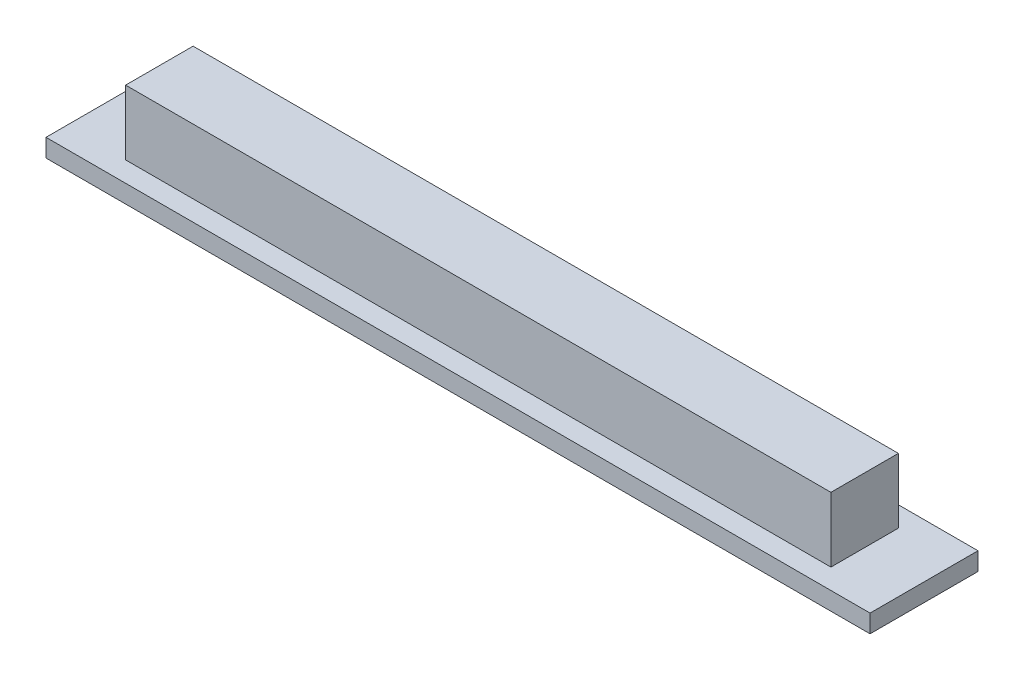
ISO-10303-21;
HEADER;
FILE_DESCRIPTION(('STEP AP214'),'2;1');
FILE_NAME('part.step','',(''),(''),'','','');
FILE_SCHEMA(('AUTOMOTIVE_DESIGN { 1 0 10303 214 1 1 1 1 }'));
ENDSEC;
DATA;
#1=APPLICATION_CONTEXT('core data for automotive mechanical design processes');
#2=APPLICATION_PROTOCOL_DEFINITION('international standard','automotive_design',2000,#1);
#3=PRODUCT_CONTEXT('',#1,'mechanical');
#4=PRODUCT('Part','Part','',(#3));
#5=PRODUCT_RELATED_PRODUCT_CATEGORY('part','',(#4));
#6=PRODUCT_DEFINITION_FORMATION('','',#4);
#7=PRODUCT_DEFINITION_CONTEXT('part definition',#1,'design');
#8=PRODUCT_DEFINITION('design','',#6,#7);
#9=PRODUCT_DEFINITION_SHAPE('','',#8);
#10=(LENGTH_UNIT() NAMED_UNIT(*) SI_UNIT(.MILLI.,.METRE.));
#11=(NAMED_UNIT(*) PLANE_ANGLE_UNIT() SI_UNIT($,.RADIAN.));
#12=(NAMED_UNIT(*) SI_UNIT($,.STERADIAN.) SOLID_ANGLE_UNIT());
#13=UNCERTAINTY_MEASURE_WITH_UNIT(LENGTH_MEASURE(1.E-05),#10,'distance_accuracy_value','');
#14=(GEOMETRIC_REPRESENTATION_CONTEXT(3) GLOBAL_UNCERTAINTY_ASSIGNED_CONTEXT((#13)) GLOBAL_UNIT_ASSIGNED_CONTEXT((#10,
#11,#12)) REPRESENTATION_CONTEXT('',''));
#15=CARTESIAN_POINT('',(0.,0.,0.));
#16=DIRECTION('',(0.,0.,1.));
#17=DIRECTION('',(1.,0.,0.));
#18=AXIS2_PLACEMENT_3D('',#15,#16,#17);
#19=CARTESIAN_POINT('',(0.,1.,0.));
#20=DIRECTION('',(0.,1.,0.));
#21=DIRECTION('',(0.,0.,1.));
#22=AXIS2_PLACEMENT_3D('',#19,#20,#21);
#23=PLANE('',#22);
#24=DIRECTION('',(0.,0.,-1.));
#25=VECTOR('',#24,1.);
#26=CARTESIAN_POINT('',(22.9,1.,-3.));
#27=LINE('',#26,#25);
#28=CARTESIAN_POINT('',(22.9,1.,3.));
#29=VERTEX_POINT('',#28);
#30=CARTESIAN_POINT('',(22.9,1.,-3.));
#31=VERTEX_POINT('',#30);
#32=EDGE_CURVE('E131',#29,#31,#27,.T.);
#33=ORIENTED_EDGE('',*,*,#32,.T.);
#34=DIRECTION('',(-1.,0.,0.));
#35=VECTOR('',#34,1.);
#36=CARTESIAN_POINT('',(-22.9,1.,-3.));
#37=LINE('',#36,#35);
#38=CARTESIAN_POINT('',(-22.9,1.,-3.));
#39=VERTEX_POINT('',#38);
#40=EDGE_CURVE('E134',#31,#39,#37,.T.);
#41=ORIENTED_EDGE('',*,*,#40,.T.);
#42=DIRECTION('',(0.,0.,1.));
#43=VECTOR('',#42,1.);
#44=CARTESIAN_POINT('',(-22.9,1.,-3.));
#45=LINE('',#44,#43);
#46=CARTESIAN_POINT('',(-22.9,1.,3.));
#47=VERTEX_POINT('',#46);
#48=EDGE_CURVE('E137',#39,#47,#45,.T.);
#49=ORIENTED_EDGE('',*,*,#48,.T.);
#50=DIRECTION('',(1.,0.,0.));
#51=VECTOR('',#50,1.);
#52=CARTESIAN_POINT('',(-22.9,1.,3.));
#53=LINE('',#52,#51);
#54=EDGE_CURVE('E139',#47,#29,#53,.T.);
#55=ORIENTED_EDGE('',*,*,#54,.T.);
#56=EDGE_LOOP('',(#33,#41,#49,#55));
#57=FACE_BOUND('',#56,.T.);
#58=DIRECTION('',(1.,0.,0.));
#59=VECTOR('',#58,1.);
#60=CARTESIAN_POINT('',(-19.6,1.,1.875));
#61=LINE('',#60,#59);
#62=CARTESIAN_POINT('',(-19.6,1.,1.875));
#63=VERTEX_POINT('',#62);
#64=CARTESIAN_POINT('',(19.6,1.,1.875));
#65=VERTEX_POINT('',#64);
#66=EDGE_CURVE('E50',#63,#65,#61,.T.);
#67=ORIENTED_EDGE('',*,*,#66,.F.);
#68=DIRECTION('',(0.,0.,1.));
#69=VECTOR('',#68,1.);
#70=CARTESIAN_POINT('',(-19.6,1.,-1.875));
#71=LINE('',#70,#69);
#72=CARTESIAN_POINT('',(-19.6,1.,-1.875));
#73=VERTEX_POINT('',#72);
#74=EDGE_CURVE('E121',#73,#63,#71,.T.);
#75=ORIENTED_EDGE('',*,*,#74,.F.);
#76=DIRECTION('',(1.,0.,0.));
#77=VECTOR('',#76,1.);
#78=CARTESIAN_POINT('',(-19.6,1.,-1.875));
#79=LINE('',#78,#77);
#80=CARTESIAN_POINT('',(19.6,1.,-1.875));
#81=VERTEX_POINT('',#80);
#82=EDGE_CURVE('E118',#73,#81,#79,.T.);
#83=ORIENTED_EDGE('',*,*,#82,.T.);
#84=DIRECTION('',(0.,0.,1.));
#85=VECTOR('',#84,1.);
#86=CARTESIAN_POINT('',(19.6,1.,-1.875));
#87=LINE('',#86,#85);
#88=EDGE_CURVE('E55',#81,#65,#87,.T.);
#89=ORIENTED_EDGE('',*,*,#88,.T.);
#90=EDGE_LOOP('',(#67,#75,#83,#89));
#91=FACE_BOUND('',#90,.T.);
#92=ADVANCED_FACE('F35',(#57,#91),#23,.T.);
#93=CARTESIAN_POINT('',(22.9,1.,-3.));
#94=DIRECTION('',(-1.,0.,0.));
#95=DIRECTION('',(0.,0.,1.));
#96=AXIS2_PLACEMENT_3D('',#93,#94,#95);
#97=PLANE('',#96);
#98=DIRECTION('',(0.,0.,-1.));
#99=VECTOR('',#98,1.);
#100=CARTESIAN_POINT('',(22.9,0.,-3.));
#101=LINE('',#100,#99);
#102=CARTESIAN_POINT('',(22.9,0.,3.));
#103=VERTEX_POINT('',#102);
#104=CARTESIAN_POINT('',(22.9,0.,-3.));
#105=VERTEX_POINT('',#104);
#106=EDGE_CURVE('E122',#103,#105,#101,.T.);
#107=ORIENTED_EDGE('',*,*,#106,.T.);
#108=DIRECTION('',(0.,-1.,0.));
#109=VECTOR('',#108,1.);
#110=CARTESIAN_POINT('',(22.9,1.,-3.));
#111=LINE('',#110,#109);
#112=EDGE_CURVE('E11',#31,#105,#111,.T.);
#113=ORIENTED_EDGE('',*,*,#112,.F.);
#114=ORIENTED_EDGE('',*,*,#32,.F.);
#115=DIRECTION('',(0.,-1.,0.));
#116=VECTOR('',#115,1.);
#117=CARTESIAN_POINT('',(22.9,1.,3.));
#118=LINE('',#117,#116);
#119=EDGE_CURVE('E140',#29,#103,#118,.T.);
#120=ORIENTED_EDGE('',*,*,#119,.T.);
#121=EDGE_LOOP('',(#107,#113,#114,#120));
#122=FACE_BOUND('',#121,.T.);
#123=ADVANCED_FACE('F37',(#122),#97,.F.);
#124=CARTESIAN_POINT('',(-22.9,1.,-3.));
#125=DIRECTION('',(0.,0.,1.));
#126=DIRECTION('',(1.,0.,0.));
#127=AXIS2_PLACEMENT_3D('',#124,#125,#126);
#128=PLANE('',#127);
#129=DIRECTION('',(-1.,0.,0.));
#130=VECTOR('',#129,1.);
#131=CARTESIAN_POINT('',(-22.9,0.,-3.));
#132=LINE('',#131,#130);
#133=CARTESIAN_POINT('',(-22.9,0.,-3.));
#134=VERTEX_POINT('',#133);
#135=EDGE_CURVE('E125',#105,#134,#132,.T.);
#136=ORIENTED_EDGE('',*,*,#135,.T.);
#137=DIRECTION('',(0.,-1.,0.));
#138=VECTOR('',#137,1.);
#139=CARTESIAN_POINT('',(-22.9,1.,-3.));
#140=LINE('',#139,#138);
#141=EDGE_CURVE('E43',#39,#134,#140,.T.);
#142=ORIENTED_EDGE('',*,*,#141,.F.);
#143=ORIENTED_EDGE('',*,*,#40,.F.);
#144=ORIENTED_EDGE('',*,*,#112,.T.);
#145=EDGE_LOOP('',(#136,#142,#143,#144));
#146=FACE_BOUND('',#145,.T.);
#147=ADVANCED_FACE('F170',(#146),#128,.F.);
#148=CARTESIAN_POINT('',(-22.9,1.,-3.));
#149=DIRECTION('',(1.,0.,0.));
#150=DIRECTION('',(0.,0.,-1.));
#151=AXIS2_PLACEMENT_3D('',#148,#149,#150);
#152=PLANE('',#151);
#153=DIRECTION('',(0.,0.,1.));
#154=VECTOR('',#153,1.);
#155=CARTESIAN_POINT('',(-22.9,0.,-3.));
#156=LINE('',#155,#154);
#157=CARTESIAN_POINT('',(-22.9,0.,3.));
#158=VERTEX_POINT('',#157);
#159=EDGE_CURVE('E143',#134,#158,#156,.T.);
#160=ORIENTED_EDGE('',*,*,#159,.T.);
#161=DIRECTION('',(0.,-1.,0.));
#162=VECTOR('',#161,1.);
#163=CARTESIAN_POINT('',(-22.9,1.,3.));
#164=LINE('',#163,#162);
#165=EDGE_CURVE('E148',#47,#158,#164,.T.);
#166=ORIENTED_EDGE('',*,*,#165,.F.);
#167=ORIENTED_EDGE('',*,*,#48,.F.);
#168=ORIENTED_EDGE('',*,*,#141,.T.);
#169=EDGE_LOOP('',(#160,#166,#167,#168));
#170=FACE_BOUND('',#169,.T.);
#171=ADVANCED_FACE('F155',(#170),#152,.F.);
#172=CARTESIAN_POINT('',(-22.9,1.,3.));
#173=DIRECTION('',(0.,0.,-1.));
#174=DIRECTION('',(-1.,0.,0.));
#175=AXIS2_PLACEMENT_3D('',#172,#173,#174);
#176=PLANE('',#175);
#177=DIRECTION('',(1.,0.,0.));
#178=VECTOR('',#177,1.);
#179=CARTESIAN_POINT('',(-22.9,0.,3.));
#180=LINE('',#179,#178);
#181=EDGE_CURVE('E135',#158,#103,#180,.T.);
#182=ORIENTED_EDGE('',*,*,#181,.T.);
#183=ORIENTED_EDGE('',*,*,#119,.F.);
#184=ORIENTED_EDGE('',*,*,#54,.F.);
#185=ORIENTED_EDGE('',*,*,#165,.T.);
#186=EDGE_LOOP('',(#182,#183,#184,#185));
#187=FACE_BOUND('',#186,.T.);
#188=ADVANCED_FACE('F164',(#187),#176,.F.);
#189=CARTESIAN_POINT('',(0.,0.,0.));
#190=DIRECTION('',(0.,1.,0.));
#191=DIRECTION('',(0.,0.,1.));
#192=AXIS2_PLACEMENT_3D('',#189,#190,#191);
#193=PLANE('',#192);
#194=ORIENTED_EDGE('',*,*,#106,.F.);
#195=ORIENTED_EDGE('',*,*,#181,.F.);
#196=ORIENTED_EDGE('',*,*,#159,.F.);
#197=ORIENTED_EDGE('',*,*,#135,.F.);
#198=EDGE_LOOP('',(#194,#195,#196,#197));
#199=FACE_BOUND('',#198,.T.);
#200=ADVANCED_FACE('F161',(#199),#193,.F.);
#201=CARTESIAN_POINT('',(-19.6,4.6,-1.875));
#202=DIRECTION('',(1.,0.,0.));
#203=DIRECTION('',(0.,0.,-1.));
#204=AXIS2_PLACEMENT_3D('',#201,#202,#203);
#205=PLANE('',#204);
#206=ORIENTED_EDGE('',*,*,#74,.T.);
#207=DIRECTION('',(0.,-1.,0.));
#208=VECTOR('',#207,1.);
#209=CARTESIAN_POINT('',(-19.6,4.6,1.875));
#210=LINE('',#209,#208);
#211=CARTESIAN_POINT('',(-19.6,4.6,1.875));
#212=VERTEX_POINT('',#211);
#213=EDGE_CURVE('E102',#212,#63,#210,.T.);
#214=ORIENTED_EDGE('',*,*,#213,.F.);
#215=DIRECTION('',(0.,0.,1.));
#216=VECTOR('',#215,1.);
#217=CARTESIAN_POINT('',(-19.6,4.6,-1.875));
#218=LINE('',#217,#216);
#219=CARTESIAN_POINT('',(-19.6,4.6,-1.875));
#220=VERTEX_POINT('',#219);
#221=EDGE_CURVE('E109',#220,#212,#218,.T.);
#222=ORIENTED_EDGE('',*,*,#221,.F.);
#223=DIRECTION('',(0.,-1.,0.));
#224=VECTOR('',#223,1.);
#225=CARTESIAN_POINT('',(-19.6,4.6,-1.875));
#226=LINE('',#225,#224);
#227=EDGE_CURVE('E263',#220,#73,#226,.T.);
#228=ORIENTED_EDGE('',*,*,#227,.T.);
#229=EDGE_LOOP('',(#206,#214,#222,#228));
#230=FACE_BOUND('',#229,.T.);
#231=ADVANCED_FACE('F120',(#230),#205,.F.);
#232=CARTESIAN_POINT('',(-19.6,4.6,1.875));
#233=DIRECTION('',(0.,0.,-1.));
#234=DIRECTION('',(-1.,0.,0.));
#235=AXIS2_PLACEMENT_3D('',#232,#233,#234);
#236=PLANE('',#235);
#237=ORIENTED_EDGE('',*,*,#66,.T.);
#238=DIRECTION('',(0.,-1.,0.));
#239=VECTOR('',#238,1.);
#240=CARTESIAN_POINT('',(19.6,4.6,1.875));
#241=LINE('',#240,#239);
#242=CARTESIAN_POINT('',(19.6,4.6,1.875));
#243=VERTEX_POINT('',#242);
#244=EDGE_CURVE('E104',#243,#65,#241,.T.);
#245=ORIENTED_EDGE('',*,*,#244,.F.);
#246=DIRECTION('',(1.,0.,0.));
#247=VECTOR('',#246,1.);
#248=CARTESIAN_POINT('',(-19.6,4.6,1.875));
#249=LINE('',#248,#247);
#250=EDGE_CURVE('E98',#212,#243,#249,.T.);
#251=ORIENTED_EDGE('',*,*,#250,.F.);
#252=ORIENTED_EDGE('',*,*,#213,.T.);
#253=EDGE_LOOP('',(#237,#245,#251,#252));
#254=FACE_BOUND('',#253,.T.);
#255=ADVANCED_FACE('F100',(#254),#236,.F.);
#256=CARTESIAN_POINT('',(19.6,4.6,-1.875));
#257=DIRECTION('',(1.,0.,0.));
#258=DIRECTION('',(0.,0.,-1.));
#259=AXIS2_PLACEMENT_3D('',#256,#257,#258);
#260=PLANE('',#259);
#261=ORIENTED_EDGE('',*,*,#88,.F.);
#262=DIRECTION('',(0.,-1.,0.));
#263=VECTOR('',#262,1.);
#264=CARTESIAN_POINT('',(19.6,4.6,-1.875));
#265=LINE('',#264,#263);
#266=CARTESIAN_POINT('',(19.6,4.6,-1.875));
#267=VERTEX_POINT('',#266);
#268=EDGE_CURVE('E127',#267,#81,#265,.T.);
#269=ORIENTED_EDGE('',*,*,#268,.F.);
#270=DIRECTION('',(0.,0.,1.));
#271=VECTOR('',#270,1.);
#272=CARTESIAN_POINT('',(19.6,4.6,-1.875));
#273=LINE('',#272,#271);
#274=EDGE_CURVE('E108',#267,#243,#273,.T.);
#275=ORIENTED_EDGE('',*,*,#274,.T.);
#276=ORIENTED_EDGE('',*,*,#244,.T.);
#277=EDGE_LOOP('',(#261,#269,#275,#276));
#278=FACE_BOUND('',#277,.T.);
#279=ADVANCED_FACE('F206',(#278),#260,.T.);
#280=CARTESIAN_POINT('',(-19.6,4.6,-1.875));
#281=DIRECTION('',(0.,0.,-1.));
#282=DIRECTION('',(-1.,0.,0.));
#283=AXIS2_PLACEMENT_3D('',#280,#281,#282);
#284=PLANE('',#283);
#285=ORIENTED_EDGE('',*,*,#82,.F.);
#286=ORIENTED_EDGE('',*,*,#227,.F.);
#287=DIRECTION('',(1.,0.,0.));
#288=VECTOR('',#287,1.);
#289=CARTESIAN_POINT('',(-19.6,4.6,-1.875));
#290=LINE('',#289,#288);
#291=EDGE_CURVE('E115',#220,#267,#290,.T.);
#292=ORIENTED_EDGE('',*,*,#291,.T.);
#293=ORIENTED_EDGE('',*,*,#268,.T.);
#294=EDGE_LOOP('',(#285,#286,#292,#293));
#295=FACE_BOUND('',#294,.T.);
#296=ADVANCED_FACE('F212',(#295),#284,.T.);
#297=CARTESIAN_POINT('',(0.,4.6,0.));
#298=DIRECTION('',(0.,1.,0.));
#299=DIRECTION('',(0.,0.,1.));
#300=AXIS2_PLACEMENT_3D('',#297,#298,#299);
#301=PLANE('',#300);
#302=ORIENTED_EDGE('',*,*,#221,.T.);
#303=ORIENTED_EDGE('',*,*,#250,.T.);
#304=ORIENTED_EDGE('',*,*,#274,.F.);
#305=ORIENTED_EDGE('',*,*,#291,.F.);
#306=EDGE_LOOP('',(#302,#303,#304,#305));
#307=FACE_BOUND('',#306,.T.);
#308=ADVANCED_FACE('F113',(#307),#301,.T.);
#309=CLOSED_SHELL('',(#92,#123,#147,#171,#188,#200,#231,#255,#279,#296,#308));
#310=MANIFOLD_SOLID_BREP('B2',#309);
#311=ADVANCED_BREP_SHAPE_REPRESENTATION('',(#18,#310),#14);
#312=SHAPE_DEFINITION_REPRESENTATION(#9,#311);
ENDSEC;
END-ISO-10303-21;
